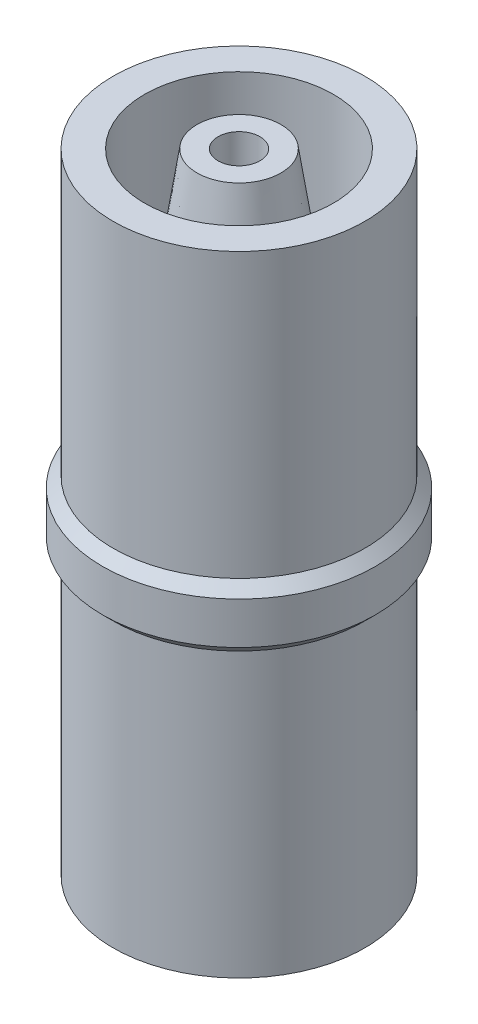
ISO-10303-21;
HEADER;
FILE_DESCRIPTION(('STEP AP214'),'2;1');
FILE_NAME('part.step','',(''),(''),'','','');
FILE_SCHEMA(('AUTOMOTIVE_DESIGN { 1 0 10303 214 1 1 1 1 }'));
ENDSEC;
DATA;
#1=APPLICATION_CONTEXT('core data for automotive mechanical design processes');
#2=APPLICATION_PROTOCOL_DEFINITION('international standard','automotive_design',2000,#1);
#3=PRODUCT_CONTEXT('',#1,'mechanical');
#4=PRODUCT('Part','Part','',(#3));
#5=PRODUCT_RELATED_PRODUCT_CATEGORY('part','',(#4));
#6=PRODUCT_DEFINITION_FORMATION('','',#4);
#7=PRODUCT_DEFINITION_CONTEXT('part definition',#1,'design');
#8=PRODUCT_DEFINITION('design','',#6,#7);
#9=PRODUCT_DEFINITION_SHAPE('','',#8);
#10=(LENGTH_UNIT() NAMED_UNIT(*) SI_UNIT(.MILLI.,.METRE.));
#11=(NAMED_UNIT(*) PLANE_ANGLE_UNIT() SI_UNIT($,.RADIAN.));
#12=(NAMED_UNIT(*) SI_UNIT($,.STERADIAN.) SOLID_ANGLE_UNIT());
#13=UNCERTAINTY_MEASURE_WITH_UNIT(LENGTH_MEASURE(1.E-05),#10,'distance_accuracy_value','');
#14=(GEOMETRIC_REPRESENTATION_CONTEXT(3) GLOBAL_UNCERTAINTY_ASSIGNED_CONTEXT((#13)) GLOBAL_UNIT_ASSIGNED_CONTEXT((#10,
#11,#12)) REPRESENTATION_CONTEXT('',''));
#15=CARTESIAN_POINT('',(0.,0.,0.));
#16=DIRECTION('',(0.,0.,1.));
#17=DIRECTION('',(1.,0.,0.));
#18=AXIS2_PLACEMENT_3D('',#15,#16,#17);
#19=CARTESIAN_POINT('',(1.99999999999999,16.5,0.));
#20=DIRECTION('',(0.,-1.,0.));
#21=DIRECTION('',(1.,0.,0.));
#22=AXIS2_PLACEMENT_3D('',#19,#20,#21);
#23=PLANE('',#22);
#24=CARTESIAN_POINT('',(0.,16.5,0.));
#25=DIRECTION('',(0.,1.,0.));
#26=DIRECTION('',(-1.,0.,0.));
#27=AXIS2_PLACEMENT_3D('',#24,#25,#26);
#28=CIRCLE('',#27,1.99999999999999);
#29=CARTESIAN_POINT('',(-1.99999999999999,16.5,0.));
#30=VERTEX_POINT('',#29);
#31=EDGE_CURVE('E10',#30,#30,#28,.T.);
#32=ORIENTED_EDGE('',*,*,#31,.F.);
#33=EDGE_LOOP('',(#32));
#34=FACE_BOUND('',#33,.T.);
#35=CARTESIAN_POINT('',(0.,16.5,0.));
#36=DIRECTION('',(0.,1.,0.));
#37=DIRECTION('',(-1.,0.,0.));
#38=AXIS2_PLACEMENT_3D('',#35,#36,#37);
#39=CIRCLE('',#38,4.5);
#40=CARTESIAN_POINT('',(-4.5,16.5,0.));
#41=VERTEX_POINT('',#40);
#42=EDGE_CURVE('E134',#41,#41,#39,.T.);
#43=ORIENTED_EDGE('',*,*,#42,.T.);
#44=EDGE_LOOP('',(#43));
#45=FACE_BOUND('',#44,.T.);
#46=ADVANCED_FACE('F37',(#34,#45),#23,.F.);
#47=CARTESIAN_POINT('',(0.,30.,0.));
#48=DIRECTION('',(0.,1.,0.));
#49=DIRECTION('',(-1.,0.,0.));
#50=AXIS2_PLACEMENT_3D('',#47,#48,#49);
#51=CYLINDRICAL_SURFACE('',#50,1.99999999999999);
#52=CARTESIAN_POINT('',(0.,20.,0.));
#53=DIRECTION('',(0.,1.,0.));
#54=DIRECTION('',(-1.,0.,0.));
#55=AXIS2_PLACEMENT_3D('',#52,#53,#54);
#56=CIRCLE('',#55,1.99999999999999);
#57=CARTESIAN_POINT('',(-1.99999999999999,20.,0.));
#58=VERTEX_POINT('',#57);
#59=EDGE_CURVE('E43',#58,#58,#56,.T.);
#60=ORIENTED_EDGE('',*,*,#59,.F.);
#61=EDGE_LOOP('',(#60));
#62=FACE_BOUND('',#61,.T.);
#63=ORIENTED_EDGE('',*,*,#31,.T.);
#64=EDGE_LOOP('',(#63));
#65=FACE_BOUND('',#64,.T.);
#66=ADVANCED_FACE('F309',(#62,#65),#51,.T.);
#67=CARTESIAN_POINT('',(2.49999999999999,20.,0.));
#68=DIRECTION('',(0.,1.,0.));
#69=DIRECTION('',(-1.,0.,0.));
#70=AXIS2_PLACEMENT_3D('',#67,#68,#69);
#71=PLANE('',#70);
#72=CARTESIAN_POINT('',(0.,20.,0.));
#73=DIRECTION('',(0.,1.,0.));
#74=DIRECTION('',(-1.,0.,0.));
#75=AXIS2_PLACEMENT_3D('',#72,#73,#74);
#76=CIRCLE('',#75,2.49999999999999);
#77=CARTESIAN_POINT('',(-2.49999999999999,20.,0.));
#78=VERTEX_POINT('',#77);
#79=EDGE_CURVE('E47',#78,#78,#76,.T.);
#80=ORIENTED_EDGE('',*,*,#79,.F.);
#81=EDGE_LOOP('',(#80));
#82=FACE_BOUND('',#81,.T.);
#83=ORIENTED_EDGE('',*,*,#59,.T.);
#84=EDGE_LOOP('',(#83));
#85=FACE_BOUND('',#84,.T.);
#86=ADVANCED_FACE('F304',(#82,#85),#71,.F.);
#87=CARTESIAN_POINT('',(0.,20.,0.));
#88=DIRECTION('',(0.,-1.,0.));
#89=DIRECTION('',(1.,0.,0.));
#90=AXIS2_PLACEMENT_3D('',#87,#88,#89);
#91=CONICAL_SURFACE('',#90,2.49999999999999,0.148889947609497);
#92=CARTESIAN_POINT('',(0.,23.3333333333333,0.));
#93=DIRECTION('',(0.,1.,0.));
#94=DIRECTION('',(-1.,0.,0.));
#95=AXIS2_PLACEMENT_3D('',#92,#93,#94);
#96=CIRCLE('',#95,1.99999999999999);
#97=CARTESIAN_POINT('',(-1.99999999999999,23.3333333333333,0.));
#98=VERTEX_POINT('',#97);
#99=EDGE_CURVE('E51',#98,#98,#96,.T.);
#100=ORIENTED_EDGE('',*,*,#99,.F.);
#101=EDGE_LOOP('',(#100));
#102=FACE_BOUND('',#101,.T.);
#103=ORIENTED_EDGE('',*,*,#79,.T.);
#104=EDGE_LOOP('',(#103));
#105=FACE_BOUND('',#104,.T.);
#106=ADVANCED_FACE('F298',(#102,#105),#91,.T.);
#107=CARTESIAN_POINT('',(2.49999999999999,23.3333333333333,0.));
#108=DIRECTION('',(0.,1.,0.));
#109=DIRECTION('',(-1.,0.,0.));
#110=AXIS2_PLACEMENT_3D('',#107,#108,#109);
#111=PLANE('',#110);
#112=CARTESIAN_POINT('',(0.,23.3333333333333,0.));
#113=DIRECTION('',(0.,1.,0.));
#114=DIRECTION('',(-1.,0.,0.));
#115=AXIS2_PLACEMENT_3D('',#112,#113,#114);
#116=CIRCLE('',#115,2.49999999999999);
#117=CARTESIAN_POINT('',(-2.49999999999999,23.3333333333333,0.));
#118=VERTEX_POINT('',#117);
#119=EDGE_CURVE('E56',#118,#118,#116,.T.);
#120=ORIENTED_EDGE('',*,*,#119,.F.);
#121=EDGE_LOOP('',(#120));
#122=FACE_BOUND('',#121,.T.);
#123=ORIENTED_EDGE('',*,*,#99,.T.);
#124=EDGE_LOOP('',(#123));
#125=FACE_BOUND('',#124,.T.);
#126=ADVANCED_FACE('F292',(#122,#125),#111,.F.);
#127=CARTESIAN_POINT('',(0.,23.3333333333333,0.));
#128=DIRECTION('',(0.,-1.,0.));
#129=DIRECTION('',(1.,0.,0.));
#130=AXIS2_PLACEMENT_3D('',#127,#128,#129);
#131=CONICAL_SURFACE('',#130,2.49999999999999,0.148889947609497);
#132=CARTESIAN_POINT('',(0.,26.6666666666667,0.));
#133=DIRECTION('',(0.,1.,0.));
#134=DIRECTION('',(-1.,0.,0.));
#135=AXIS2_PLACEMENT_3D('',#132,#133,#134);
#136=CIRCLE('',#135,1.99999999999999);
#137=CARTESIAN_POINT('',(-1.99999999999999,26.6666666666667,0.));
#138=VERTEX_POINT('',#137);
#139=EDGE_CURVE('E59',#138,#138,#136,.T.);
#140=ORIENTED_EDGE('',*,*,#139,.F.);
#141=EDGE_LOOP('',(#140));
#142=FACE_BOUND('',#141,.T.);
#143=ORIENTED_EDGE('',*,*,#119,.T.);
#144=EDGE_LOOP('',(#143));
#145=FACE_BOUND('',#144,.T.);
#146=ADVANCED_FACE('F286',(#142,#145),#131,.T.);
#147=CARTESIAN_POINT('',(2.49999999999999,26.6666666666667,0.));
#148=DIRECTION('',(0.,1.,0.));
#149=DIRECTION('',(-1.,0.,0.));
#150=AXIS2_PLACEMENT_3D('',#147,#148,#149);
#151=PLANE('',#150);
#152=CARTESIAN_POINT('',(0.,26.6666666666667,0.));
#153=DIRECTION('',(0.,1.,0.));
#154=DIRECTION('',(-1.,0.,0.));
#155=AXIS2_PLACEMENT_3D('',#152,#153,#154);
#156=CIRCLE('',#155,2.49999999999999);
#157=CARTESIAN_POINT('',(-2.49999999999999,26.6666666666667,0.));
#158=VERTEX_POINT('',#157);
#159=EDGE_CURVE('E62',#158,#158,#156,.T.);
#160=ORIENTED_EDGE('',*,*,#159,.F.);
#161=EDGE_LOOP('',(#160));
#162=FACE_BOUND('',#161,.T.);
#163=ORIENTED_EDGE('',*,*,#139,.T.);
#164=EDGE_LOOP('',(#163));
#165=FACE_BOUND('',#164,.T.);
#166=ADVANCED_FACE('F280',(#162,#165),#151,.F.);
#167=CARTESIAN_POINT('',(0.,26.6666666666667,0.));
#168=DIRECTION('',(0.,-1.,0.));
#169=DIRECTION('',(1.,0.,0.));
#170=AXIS2_PLACEMENT_3D('',#167,#168,#169);
#171=CONICAL_SURFACE('',#170,2.49999999999999,0.148889947609497);
#172=CARTESIAN_POINT('',(0.,30.,0.));
#173=DIRECTION('',(0.,1.,0.));
#174=DIRECTION('',(-1.,0.,0.));
#175=AXIS2_PLACEMENT_3D('',#172,#173,#174);
#176=CIRCLE('',#175,1.99999999999999);
#177=CARTESIAN_POINT('',(-1.99999999999999,30.,0.));
#178=VERTEX_POINT('',#177);
#179=EDGE_CURVE('E65',#178,#178,#176,.T.);
#180=ORIENTED_EDGE('',*,*,#179,.F.);
#181=EDGE_LOOP('',(#180));
#182=FACE_BOUND('',#181,.T.);
#183=ORIENTED_EDGE('',*,*,#159,.T.);
#184=EDGE_LOOP('',(#183));
#185=FACE_BOUND('',#184,.T.);
#186=ADVANCED_FACE('F274',(#182,#185),#171,.T.);
#187=CARTESIAN_POINT('',(0.999999999999993,30.,0.));
#188=DIRECTION('',(0.,-1.,0.));
#189=DIRECTION('',(1.,0.,0.));
#190=AXIS2_PLACEMENT_3D('',#187,#188,#189);
#191=PLANE('',#190);
#192=CARTESIAN_POINT('',(0.,30.,0.));
#193=DIRECTION('',(0.,1.,0.));
#194=DIRECTION('',(-1.,0.,0.));
#195=AXIS2_PLACEMENT_3D('',#192,#193,#194);
#196=CIRCLE('',#195,0.999999999999993);
#197=CARTESIAN_POINT('',(-0.999999999999993,30.,0.));
#198=VERTEX_POINT('',#197);
#199=EDGE_CURVE('E68',#198,#198,#196,.T.);
#200=ORIENTED_EDGE('',*,*,#199,.F.);
#201=EDGE_LOOP('',(#200));
#202=FACE_BOUND('',#201,.T.);
#203=ORIENTED_EDGE('',*,*,#179,.T.);
#204=EDGE_LOOP('',(#203));
#205=FACE_BOUND('',#204,.T.);
#206=ADVANCED_FACE('F268',(#202,#205),#191,.F.);
#207=CARTESIAN_POINT('',(0.,30.,0.));
#208=DIRECTION('',(0.,1.,0.));
#209=DIRECTION('',(-1.,0.,0.));
#210=AXIS2_PLACEMENT_3D('',#207,#208,#209);
#211=CYLINDRICAL_SURFACE('',#210,0.999999999999992);
#212=CARTESIAN_POINT('',(0.,11.3339745962156,0.));
#213=DIRECTION('',(0.,1.,0.));
#214=DIRECTION('',(-1.,0.,0.));
#215=AXIS2_PLACEMENT_3D('',#212,#213,#214);
#216=CIRCLE('',#215,0.999999999999992);
#217=CARTESIAN_POINT('',(-0.999999999999992,11.3339745962156,0.));
#218=VERTEX_POINT('',#217);
#219=EDGE_CURVE('E71',#218,#218,#216,.T.);
#220=ORIENTED_EDGE('',*,*,#219,.F.);
#221=EDGE_LOOP('',(#220));
#222=FACE_BOUND('',#221,.T.);
#223=ORIENTED_EDGE('',*,*,#199,.T.);
#224=EDGE_LOOP('',(#223));
#225=FACE_BOUND('',#224,.T.);
#226=ADVANCED_FACE('F262',(#222,#225),#211,.F.);
#227=CARTESIAN_POINT('',(0.,11.3339745962156,0.));
#228=DIRECTION('',(0.,1.,0.));
#229=DIRECTION('',(-1.,0.,0.));
#230=AXIS2_PLACEMENT_3D('',#227,#228,#229);
#231=CONICAL_SURFACE('',#230,0.999999999999992,0.261799387799144);
#232=CARTESIAN_POINT('',(0.,10.2143593539449,0.));
#233=DIRECTION('',(0.,1.,0.));
#234=DIRECTION('',(-1.,0.,0.));
#235=AXIS2_PLACEMENT_3D('',#232,#233,#234);
#236=CIRCLE('',#235,0.699999999999998);
#237=CARTESIAN_POINT('',(-0.699999999999998,10.2143593539449,0.));
#238=VERTEX_POINT('',#237);
#239=EDGE_CURVE('E74',#238,#238,#236,.T.);
#240=ORIENTED_EDGE('',*,*,#239,.F.);
#241=EDGE_LOOP('',(#240));
#242=FACE_BOUND('',#241,.T.);
#243=ORIENTED_EDGE('',*,*,#219,.T.);
#244=EDGE_LOOP('',(#243));
#245=FACE_BOUND('',#244,.T.);
#246=ADVANCED_FACE('F256',(#242,#245),#231,.F.);
#247=CARTESIAN_POINT('',(0.,30.,0.));
#248=DIRECTION('',(0.,1.,0.));
#249=DIRECTION('',(-1.,0.,0.));
#250=AXIS2_PLACEMENT_3D('',#247,#248,#249);
#251=CYLINDRICAL_SURFACE('',#250,0.699999999999999);
#252=CARTESIAN_POINT('',(0.,0.,0.));
#253=DIRECTION('',(0.,1.,0.));
#254=DIRECTION('',(-1.,0.,0.));
#255=AXIS2_PLACEMENT_3D('',#252,#253,#254);
#256=CIRCLE('',#255,0.7);
#257=CARTESIAN_POINT('',(-0.7,0.,0.));
#258=VERTEX_POINT('',#257);
#259=EDGE_CURVE('E77',#258,#258,#256,.T.);
#260=ORIENTED_EDGE('',*,*,#259,.F.);
#261=EDGE_LOOP('',(#260));
#262=FACE_BOUND('',#261,.T.);
#263=ORIENTED_EDGE('',*,*,#239,.T.);
#264=EDGE_LOOP('',(#263));
#265=FACE_BOUND('',#264,.T.);
#266=ADVANCED_FACE('F250',(#262,#265),#251,.F.);
#267=CARTESIAN_POINT('',(1.5,0.,0.));
#268=DIRECTION('',(0.,1.,0.));
#269=DIRECTION('',(-1.,0.,0.));
#270=AXIS2_PLACEMENT_3D('',#267,#268,#269);
#271=PLANE('',#270);
#272=CARTESIAN_POINT('',(0.,0.,0.));
#273=DIRECTION('',(0.,1.,0.));
#274=DIRECTION('',(-1.,0.,0.));
#275=AXIS2_PLACEMENT_3D('',#272,#273,#274);
#276=CIRCLE('',#275,1.5);
#277=CARTESIAN_POINT('',(-1.5,0.,0.));
#278=VERTEX_POINT('',#277);
#279=EDGE_CURVE('E80',#278,#278,#276,.T.);
#280=ORIENTED_EDGE('',*,*,#279,.F.);
#281=EDGE_LOOP('',(#280));
#282=FACE_BOUND('',#281,.T.);
#283=ORIENTED_EDGE('',*,*,#259,.T.);
#284=EDGE_LOOP('',(#283));
#285=FACE_BOUND('',#284,.T.);
#286=ADVANCED_FACE('F244',(#282,#285),#271,.F.);
#287=CARTESIAN_POINT('',(0.,0.,0.));
#288=DIRECTION('',(0.,1.,0.));
#289=DIRECTION('',(-1.,0.,0.));
#290=AXIS2_PLACEMENT_3D('',#287,#288,#289);
#291=CONICAL_SURFACE('',#290,1.5,0.148889947609497);
#292=CARTESIAN_POINT('',(0.,3.33333333333333,0.));
#293=DIRECTION('',(0.,1.,0.));
#294=DIRECTION('',(-1.,0.,0.));
#295=AXIS2_PLACEMENT_3D('',#292,#293,#294);
#296=CIRCLE('',#295,2.);
#297=CARTESIAN_POINT('',(-2.,3.33333333333333,0.));
#298=VERTEX_POINT('',#297);
#299=EDGE_CURVE('E83',#298,#298,#296,.T.);
#300=ORIENTED_EDGE('',*,*,#299,.F.);
#301=EDGE_LOOP('',(#300));
#302=FACE_BOUND('',#301,.T.);
#303=ORIENTED_EDGE('',*,*,#279,.T.);
#304=EDGE_LOOP('',(#303));
#305=FACE_BOUND('',#304,.T.);
#306=ADVANCED_FACE('F238',(#302,#305),#291,.T.);
#307=CARTESIAN_POINT('',(1.5,3.33333333333333,0.));
#308=DIRECTION('',(0.,-1.,0.));
#309=DIRECTION('',(1.,0.,0.));
#310=AXIS2_PLACEMENT_3D('',#307,#308,#309);
#311=PLANE('',#310);
#312=CARTESIAN_POINT('',(0.,3.33333333333333,0.));
#313=DIRECTION('',(0.,1.,0.));
#314=DIRECTION('',(-1.,0.,0.));
#315=AXIS2_PLACEMENT_3D('',#312,#313,#314);
#316=CIRCLE('',#315,1.5);
#317=CARTESIAN_POINT('',(-1.5,3.33333333333333,0.));
#318=VERTEX_POINT('',#317);
#319=EDGE_CURVE('E86',#318,#318,#316,.T.);
#320=ORIENTED_EDGE('',*,*,#319,.F.);
#321=EDGE_LOOP('',(#320));
#322=FACE_BOUND('',#321,.T.);
#323=ORIENTED_EDGE('',*,*,#299,.T.);
#324=EDGE_LOOP('',(#323));
#325=FACE_BOUND('',#324,.T.);
#326=ADVANCED_FACE('F232',(#322,#325),#311,.F.);
#327=CARTESIAN_POINT('',(0.,3.33333333333333,0.));
#328=DIRECTION('',(0.,1.,0.));
#329=DIRECTION('',(-1.,0.,0.));
#330=AXIS2_PLACEMENT_3D('',#327,#328,#329);
#331=CONICAL_SURFACE('',#330,1.5,0.148889947609497);
#332=CARTESIAN_POINT('',(0.,6.66666666666667,0.));
#333=DIRECTION('',(0.,1.,0.));
#334=DIRECTION('',(-1.,0.,0.));
#335=AXIS2_PLACEMENT_3D('',#332,#333,#334);
#336=CIRCLE('',#335,2.);
#337=CARTESIAN_POINT('',(-2.,6.66666666666667,0.));
#338=VERTEX_POINT('',#337);
#339=EDGE_CURVE('E89',#338,#338,#336,.T.);
#340=ORIENTED_EDGE('',*,*,#339,.F.);
#341=EDGE_LOOP('',(#340));
#342=FACE_BOUND('',#341,.T.);
#343=ORIENTED_EDGE('',*,*,#319,.T.);
#344=EDGE_LOOP('',(#343));
#345=FACE_BOUND('',#344,.T.);
#346=ADVANCED_FACE('F226',(#342,#345),#331,.T.);
#347=CARTESIAN_POINT('',(1.5,6.66666666666667,0.));
#348=DIRECTION('',(0.,-1.,0.));
#349=DIRECTION('',(1.,0.,0.));
#350=AXIS2_PLACEMENT_3D('',#347,#348,#349);
#351=PLANE('',#350);
#352=CARTESIAN_POINT('',(0.,6.66666666666667,0.));
#353=DIRECTION('',(0.,1.,0.));
#354=DIRECTION('',(-1.,0.,0.));
#355=AXIS2_PLACEMENT_3D('',#352,#353,#354);
#356=CIRCLE('',#355,1.5);
#357=CARTESIAN_POINT('',(-1.5,6.66666666666667,0.));
#358=VERTEX_POINT('',#357);
#359=EDGE_CURVE('E92',#358,#358,#356,.T.);
#360=ORIENTED_EDGE('',*,*,#359,.F.);
#361=EDGE_LOOP('',(#360));
#362=FACE_BOUND('',#361,.T.);
#363=ORIENTED_EDGE('',*,*,#339,.T.);
#364=EDGE_LOOP('',(#363));
#365=FACE_BOUND('',#364,.T.);
#366=ADVANCED_FACE('F220',(#362,#365),#351,.F.);
#367=CARTESIAN_POINT('',(0.,6.66666666666667,0.));
#368=DIRECTION('',(0.,1.,0.));
#369=DIRECTION('',(-1.,0.,0.));
#370=AXIS2_PLACEMENT_3D('',#367,#368,#369);
#371=CONICAL_SURFACE('',#370,1.5,0.148889947609497);
#372=CARTESIAN_POINT('',(0.,10.,0.));
#373=DIRECTION('',(0.,1.,0.));
#374=DIRECTION('',(-1.,0.,0.));
#375=AXIS2_PLACEMENT_3D('',#372,#373,#374);
#376=CIRCLE('',#375,2.);
#377=CARTESIAN_POINT('',(-2.,10.,0.));
#378=VERTEX_POINT('',#377);
#379=EDGE_CURVE('E95',#378,#378,#376,.T.);
#380=ORIENTED_EDGE('',*,*,#379,.F.);
#381=EDGE_LOOP('',(#380));
#382=FACE_BOUND('',#381,.T.);
#383=ORIENTED_EDGE('',*,*,#359,.T.);
#384=EDGE_LOOP('',(#383));
#385=FACE_BOUND('',#384,.T.);
#386=ADVANCED_FACE('F214',(#382,#385),#371,.T.);
#387=CARTESIAN_POINT('',(1.5,10.,0.));
#388=DIRECTION('',(0.,-1.,0.));
#389=DIRECTION('',(1.,0.,0.));
#390=AXIS2_PLACEMENT_3D('',#387,#388,#389);
#391=PLANE('',#390);
#392=CARTESIAN_POINT('',(0.,10.,0.));
#393=DIRECTION('',(0.,1.,0.));
#394=DIRECTION('',(-1.,0.,0.));
#395=AXIS2_PLACEMENT_3D('',#392,#393,#394);
#396=CIRCLE('',#395,1.5);
#397=CARTESIAN_POINT('',(-1.5,10.,0.));
#398=VERTEX_POINT('',#397);
#399=EDGE_CURVE('E98',#398,#398,#396,.T.);
#400=ORIENTED_EDGE('',*,*,#399,.F.);
#401=EDGE_LOOP('',(#400));
#402=FACE_BOUND('',#401,.T.);
#403=ORIENTED_EDGE('',*,*,#379,.T.);
#404=EDGE_LOOP('',(#403));
#405=FACE_BOUND('',#404,.T.);
#406=ADVANCED_FACE('F208',(#402,#405),#391,.F.);
#407=CARTESIAN_POINT('',(0.,10.,0.));
#408=DIRECTION('',(0.,1.,0.));
#409=DIRECTION('',(-1.,0.,0.));
#410=AXIS2_PLACEMENT_3D('',#407,#408,#409);
#411=CONICAL_SURFACE('',#410,1.5,0.408927473711078);
#412=CARTESIAN_POINT('',(0.,11.1537840257496,0.));
#413=DIRECTION('',(0.,1.,0.));
#414=DIRECTION('',(-1.,0.,0.));
#415=AXIS2_PLACEMENT_3D('',#412,#413,#414);
#416=CIRCLE('',#415,1.99999999999999);
#417=CARTESIAN_POINT('',(-1.99999999999999,11.1537840257496,0.));
#418=VERTEX_POINT('',#417);
#419=EDGE_CURVE('E101',#418,#418,#416,.T.);
#420=ORIENTED_EDGE('',*,*,#419,.F.);
#421=EDGE_LOOP('',(#420));
#422=FACE_BOUND('',#421,.T.);
#423=ORIENTED_EDGE('',*,*,#399,.T.);
#424=EDGE_LOOP('',(#423));
#425=FACE_BOUND('',#424,.T.);
#426=ADVANCED_FACE('F202',(#422,#425),#411,.T.);
#427=CARTESIAN_POINT('',(0.,30.,0.));
#428=DIRECTION('',(0.,1.,0.));
#429=DIRECTION('',(-1.,0.,0.));
#430=AXIS2_PLACEMENT_3D('',#427,#428,#429);
#431=CYLINDRICAL_SURFACE('',#430,1.99999999999999);
#432=CARTESIAN_POINT('',(0.,13.5,0.));
#433=DIRECTION('',(0.,1.,0.));
#434=DIRECTION('',(-1.,0.,0.));
#435=AXIS2_PLACEMENT_3D('',#432,#433,#434);
#436=CIRCLE('',#435,1.99999999999999);
#437=CARTESIAN_POINT('',(-1.99999999999999,13.5,0.));
#438=VERTEX_POINT('',#437);
#439=EDGE_CURVE('E104',#438,#438,#436,.T.);
#440=ORIENTED_EDGE('',*,*,#439,.F.);
#441=EDGE_LOOP('',(#440));
#442=FACE_BOUND('',#441,.T.);
#443=ORIENTED_EDGE('',*,*,#419,.T.);
#444=EDGE_LOOP('',(#443));
#445=FACE_BOUND('',#444,.T.);
#446=ADVANCED_FACE('F196',(#442,#445),#431,.T.);
#447=CARTESIAN_POINT('',(4.5,13.5,0.));
#448=DIRECTION('',(0.,1.,0.));
#449=DIRECTION('',(-1.,0.,0.));
#450=AXIS2_PLACEMENT_3D('',#447,#448,#449);
#451=PLANE('',#450);
#452=CARTESIAN_POINT('',(0.,13.5,0.));
#453=DIRECTION('',(0.,1.,0.));
#454=DIRECTION('',(-1.,0.,0.));
#455=AXIS2_PLACEMENT_3D('',#452,#453,#454);
#456=CIRCLE('',#455,4.5);
#457=CARTESIAN_POINT('',(-4.5,13.5,0.));
#458=VERTEX_POINT('',#457);
#459=EDGE_CURVE('E107',#458,#458,#456,.T.);
#460=ORIENTED_EDGE('',*,*,#459,.F.);
#461=EDGE_LOOP('',(#460));
#462=FACE_BOUND('',#461,.T.);
#463=ORIENTED_EDGE('',*,*,#439,.T.);
#464=EDGE_LOOP('',(#463));
#465=FACE_BOUND('',#464,.T.);
#466=ADVANCED_FACE('F190',(#462,#465),#451,.F.);
#467=CARTESIAN_POINT('',(0.,30.,0.));
#468=DIRECTION('',(0.,1.,0.));
#469=DIRECTION('',(-1.,0.,0.));
#470=AXIS2_PLACEMENT_3D('',#467,#468,#469);
#471=CYLINDRICAL_SURFACE('',#470,4.5);
#472=CARTESIAN_POINT('',(0.,0.,0.));
#473=DIRECTION('',(0.,1.,0.));
#474=DIRECTION('',(-1.,0.,0.));
#475=AXIS2_PLACEMENT_3D('',#472,#473,#474);
#476=CIRCLE('',#475,4.5);
#477=CARTESIAN_POINT('',(-4.5,0.,0.));
#478=VERTEX_POINT('',#477);
#479=EDGE_CURVE('E110',#478,#478,#476,.T.);
#480=ORIENTED_EDGE('',*,*,#479,.F.);
#481=EDGE_LOOP('',(#480));
#482=FACE_BOUND('',#481,.T.);
#483=ORIENTED_EDGE('',*,*,#459,.T.);
#484=EDGE_LOOP('',(#483));
#485=FACE_BOUND('',#484,.T.);
#486=ADVANCED_FACE('F184',(#482,#485),#471,.F.);
#487=CARTESIAN_POINT('',(6.,0.,0.));
#488=DIRECTION('',(0.,1.,0.));
#489=DIRECTION('',(-1.,0.,0.));
#490=AXIS2_PLACEMENT_3D('',#487,#488,#489);
#491=PLANE('',#490);
#492=CARTESIAN_POINT('',(0.,0.,0.));
#493=DIRECTION('',(0.,1.,0.));
#494=DIRECTION('',(-1.,0.,0.));
#495=AXIS2_PLACEMENT_3D('',#492,#493,#494);
#496=CIRCLE('',#495,6.);
#497=CARTESIAN_POINT('',(-6.,0.,0.));
#498=VERTEX_POINT('',#497);
#499=EDGE_CURVE('E113',#498,#498,#496,.T.);
#500=ORIENTED_EDGE('',*,*,#499,.F.);
#501=EDGE_LOOP('',(#500));
#502=FACE_BOUND('',#501,.T.);
#503=ORIENTED_EDGE('',*,*,#479,.T.);
#504=EDGE_LOOP('',(#503));
#505=FACE_BOUND('',#504,.T.);
#506=ADVANCED_FACE('F178',(#502,#505),#491,.F.);
#507=CARTESIAN_POINT('',(0.,30.,0.));
#508=DIRECTION('',(0.,1.,0.));
#509=DIRECTION('',(-1.,0.,0.));
#510=AXIS2_PLACEMENT_3D('',#507,#508,#509);
#511=CYLINDRICAL_SURFACE('',#510,6.);
#512=CARTESIAN_POINT('',(0.,13.5,0.));
#513=DIRECTION('',(0.,1.,0.));
#514=DIRECTION('',(-1.,0.,0.));
#515=AXIS2_PLACEMENT_3D('',#512,#513,#514);
#516=CIRCLE('',#515,6.);
#517=CARTESIAN_POINT('',(-6.,13.5,0.));
#518=VERTEX_POINT('',#517);
#519=EDGE_CURVE('E116',#518,#518,#516,.T.);
#520=ORIENTED_EDGE('',*,*,#519,.F.);
#521=EDGE_LOOP('',(#520));
#522=FACE_BOUND('',#521,.T.);
#523=ORIENTED_EDGE('',*,*,#499,.T.);
#524=EDGE_LOOP('',(#523));
#525=FACE_BOUND('',#524,.T.);
#526=ADVANCED_FACE('F172',(#522,#525),#511,.T.);
#527=CARTESIAN_POINT('',(0.,13.5,0.));
#528=DIRECTION('',(0.,1.,0.));
#529=DIRECTION('',(-1.,0.,0.));
#530=AXIS2_PLACEMENT_3D('',#527,#528,#529);
#531=CONICAL_SURFACE('',#530,6.,0.785398163397445);
#532=CARTESIAN_POINT('',(0.,14.,0.));
#533=DIRECTION('',(0.,1.,0.));
#534=DIRECTION('',(-1.,0.,0.));
#535=AXIS2_PLACEMENT_3D('',#532,#533,#534);
#536=CIRCLE('',#535,6.5);
#537=CARTESIAN_POINT('',(-6.5,14.,0.));
#538=VERTEX_POINT('',#537);
#539=EDGE_CURVE('E119',#538,#538,#536,.T.);
#540=ORIENTED_EDGE('',*,*,#539,.F.);
#541=EDGE_LOOP('',(#540));
#542=FACE_BOUND('',#541,.T.);
#543=ORIENTED_EDGE('',*,*,#519,.T.);
#544=EDGE_LOOP('',(#543));
#545=FACE_BOUND('',#544,.T.);
#546=ADVANCED_FACE('F166',(#542,#545),#531,.T.);
#547=CARTESIAN_POINT('',(0.,30.,0.));
#548=DIRECTION('',(0.,1.,0.));
#549=DIRECTION('',(-1.,0.,0.));
#550=AXIS2_PLACEMENT_3D('',#547,#548,#549);
#551=CYLINDRICAL_SURFACE('',#550,6.5);
#552=CARTESIAN_POINT('',(0.,16.,0.));
#553=DIRECTION('',(0.,1.,0.));
#554=DIRECTION('',(-1.,0.,0.));
#555=AXIS2_PLACEMENT_3D('',#552,#553,#554);
#556=CIRCLE('',#555,6.5);
#557=CARTESIAN_POINT('',(-6.5,16.,0.));
#558=VERTEX_POINT('',#557);
#559=EDGE_CURVE('E122',#558,#558,#556,.T.);
#560=ORIENTED_EDGE('',*,*,#559,.F.);
#561=EDGE_LOOP('',(#560));
#562=FACE_BOUND('',#561,.T.);
#563=ORIENTED_EDGE('',*,*,#539,.T.);
#564=EDGE_LOOP('',(#563));
#565=FACE_BOUND('',#564,.T.);
#566=ADVANCED_FACE('F160',(#562,#565),#551,.T.);
#567=CARTESIAN_POINT('',(0.,16.,0.));
#568=DIRECTION('',(0.,-1.,0.));
#569=DIRECTION('',(1.,0.,0.));
#570=AXIS2_PLACEMENT_3D('',#567,#568,#569);
#571=CONICAL_SURFACE('',#570,6.5,0.785398163397457);
#572=CARTESIAN_POINT('',(0.,16.5,0.));
#573=DIRECTION('',(0.,1.,0.));
#574=DIRECTION('',(-1.,0.,0.));
#575=AXIS2_PLACEMENT_3D('',#572,#573,#574);
#576=CIRCLE('',#575,6.);
#577=CARTESIAN_POINT('',(-6.,16.5,0.));
#578=VERTEX_POINT('',#577);
#579=EDGE_CURVE('E125',#578,#578,#576,.T.);
#580=ORIENTED_EDGE('',*,*,#579,.F.);
#581=EDGE_LOOP('',(#580));
#582=FACE_BOUND('',#581,.T.);
#583=ORIENTED_EDGE('',*,*,#559,.T.);
#584=EDGE_LOOP('',(#583));
#585=FACE_BOUND('',#584,.T.);
#586=ADVANCED_FACE('F154',(#582,#585),#571,.T.);
#587=CARTESIAN_POINT('',(0.,30.,0.));
#588=DIRECTION('',(0.,1.,0.));
#589=DIRECTION('',(-1.,0.,0.));
#590=AXIS2_PLACEMENT_3D('',#587,#588,#589);
#591=CYLINDRICAL_SURFACE('',#590,6.);
#592=CARTESIAN_POINT('',(0.,30.,0.));
#593=DIRECTION('',(0.,1.,0.));
#594=DIRECTION('',(-1.,0.,0.));
#595=AXIS2_PLACEMENT_3D('',#592,#593,#594);
#596=CIRCLE('',#595,6.);
#597=CARTESIAN_POINT('',(-6.,30.,0.));
#598=VERTEX_POINT('',#597);
#599=EDGE_CURVE('E128',#598,#598,#596,.T.);
#600=ORIENTED_EDGE('',*,*,#599,.F.);
#601=EDGE_LOOP('',(#600));
#602=FACE_BOUND('',#601,.T.);
#603=ORIENTED_EDGE('',*,*,#579,.T.);
#604=EDGE_LOOP('',(#603));
#605=FACE_BOUND('',#604,.T.);
#606=ADVANCED_FACE('F148',(#602,#605),#591,.T.);
#607=CARTESIAN_POINT('',(4.5,30.,0.));
#608=DIRECTION('',(0.,-1.,0.));
#609=DIRECTION('',(1.,0.,0.));
#610=AXIS2_PLACEMENT_3D('',#607,#608,#609);
#611=PLANE('',#610);
#612=CARTESIAN_POINT('',(0.,30.,0.));
#613=DIRECTION('',(0.,1.,0.));
#614=DIRECTION('',(-1.,0.,0.));
#615=AXIS2_PLACEMENT_3D('',#612,#613,#614);
#616=CIRCLE('',#615,4.5);
#617=CARTESIAN_POINT('',(-4.5,30.,0.));
#618=VERTEX_POINT('',#617);
#619=EDGE_CURVE('E131',#618,#618,#616,.T.);
#620=ORIENTED_EDGE('',*,*,#619,.F.);
#621=EDGE_LOOP('',(#620));
#622=FACE_BOUND('',#621,.T.);
#623=ORIENTED_EDGE('',*,*,#599,.T.);
#624=EDGE_LOOP('',(#623));
#625=FACE_BOUND('',#624,.T.);
#626=ADVANCED_FACE('F142',(#622,#625),#611,.F.);
#627=CARTESIAN_POINT('',(0.,30.,0.));
#628=DIRECTION('',(0.,1.,0.));
#629=DIRECTION('',(-1.,0.,0.));
#630=AXIS2_PLACEMENT_3D('',#627,#628,#629);
#631=CYLINDRICAL_SURFACE('',#630,4.5);
#632=ORIENTED_EDGE('',*,*,#42,.F.);
#633=EDGE_LOOP('',(#632));
#634=FACE_BOUND('',#633,.T.);
#635=ORIENTED_EDGE('',*,*,#619,.T.);
#636=EDGE_LOOP('',(#635));
#637=FACE_BOUND('',#636,.T.);
#638=ADVANCED_FACE('F139',(#634,#637),#631,.F.);
#639=CLOSED_SHELL('',(#46,#66,#86,#106,#126,#146,#166,#186,#206,#226,#246,#266,#286,#306,#326,
#346,#366,#386,#406,#426,#446,#466,#486,#506,#526,#546,#566,#586,#606,#626,#638));
#640=MANIFOLD_SOLID_BREP('B2',#639);
#641=ADVANCED_BREP_SHAPE_REPRESENTATION('',(#18,#640),#14);
#642=SHAPE_DEFINITION_REPRESENTATION(#9,#641);
ENDSEC;
END-ISO-10303-21;
